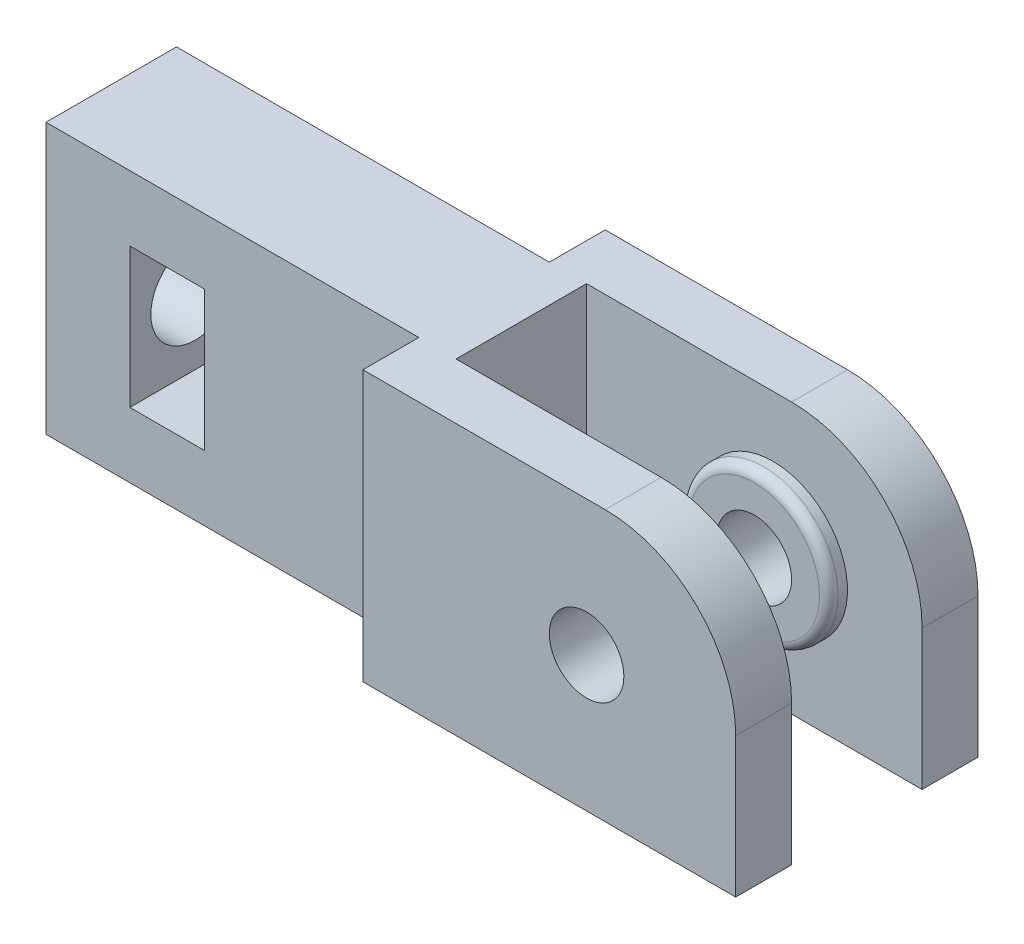
ISO-10303-21;
HEADER;
FILE_DESCRIPTION(('STEP AP214'),'2;1');
FILE_NAME('part.step','',(''),(''),'','','');
FILE_SCHEMA(('AUTOMOTIVE_DESIGN { 1 0 10303 214 1 1 1 1 }'));
ENDSEC;
DATA;
#1=APPLICATION_CONTEXT('core data for automotive mechanical design processes');
#2=APPLICATION_PROTOCOL_DEFINITION('international standard','automotive_design',2000,#1);
#3=PRODUCT_CONTEXT('',#1,'mechanical');
#4=PRODUCT('Part','Part','',(#3));
#5=PRODUCT_RELATED_PRODUCT_CATEGORY('part','',(#4));
#6=PRODUCT_DEFINITION_FORMATION('','',#4);
#7=PRODUCT_DEFINITION_CONTEXT('part definition',#1,'design');
#8=PRODUCT_DEFINITION('design','',#6,#7);
#9=PRODUCT_DEFINITION_SHAPE('','',#8);
#10=(LENGTH_UNIT() NAMED_UNIT(*) SI_UNIT(.MILLI.,.METRE.));
#11=(NAMED_UNIT(*) PLANE_ANGLE_UNIT() SI_UNIT($,.RADIAN.));
#12=(NAMED_UNIT(*) SI_UNIT($,.STERADIAN.) SOLID_ANGLE_UNIT());
#13=UNCERTAINTY_MEASURE_WITH_UNIT(LENGTH_MEASURE(1.E-05),#10,'distance_accuracy_value','');
#14=(GEOMETRIC_REPRESENTATION_CONTEXT(3) GLOBAL_UNCERTAINTY_ASSIGNED_CONTEXT((#13)) GLOBAL_UNIT_ASSIGNED_CONTEXT((#10,
#11,#12)) REPRESENTATION_CONTEXT('',''));
#15=CARTESIAN_POINT('',(0.,0.,0.));
#16=DIRECTION('',(0.,0.,1.));
#17=DIRECTION('',(1.,0.,0.));
#18=AXIS2_PLACEMENT_3D('',#15,#16,#17);
#19=CARTESIAN_POINT('',(40.,7.25,0.));
#20=DIRECTION('',(-1.,0.,0.));
#21=DIRECTION('',(0.,0.,1.));
#22=AXIS2_PLACEMENT_3D('',#19,#20,#21);
#23=CYLINDRICAL_SURFACE('',#22,2.375);
#24=CARTESIAN_POINT('',(4.5,7.25,0.));
#25=DIRECTION('',(-1.,0.,0.));
#26=DIRECTION('',(0.,-1.,0.));
#27=AXIS2_PLACEMENT_3D('',#24,#25,#26);
#28=CIRCLE('',#27,2.375);
#29=CARTESIAN_POINT('',(4.5,4.875,0.));
#30=VERTEX_POINT('',#29);
#31=EDGE_CURVE('E188',#30,#30,#28,.F.);
#32=ORIENTED_EDGE('',*,*,#31,.T.);
#33=EDGE_LOOP('',(#32));
#34=FACE_BOUND('',#33,.T.);
#35=CARTESIAN_POINT('',(0.,7.25,0.));
#36=DIRECTION('',(-1.,0.,0.));
#37=DIRECTION('',(0.,0.,1.));
#38=AXIS2_PLACEMENT_3D('',#35,#36,#37);
#39=CIRCLE('',#38,2.375);
#40=CARTESIAN_POINT('',(0.,7.25,2.375));
#41=VERTEX_POINT('',#40);
#42=EDGE_CURVE('E192',#41,#41,#39,.T.);
#43=ORIENTED_EDGE('',*,*,#42,.T.);
#44=EDGE_LOOP('',(#43));
#45=FACE_BOUND('',#44,.T.);
#46=ADVANCED_FACE('F33',(#34,#45),#23,.F.);
#47=CARTESIAN_POINT('',(40.,14.5,-3.5));
#48=DIRECTION('',(0.,0.,-1.));
#49=DIRECTION('',(-1.,0.,0.));
#50=AXIS2_PLACEMENT_3D('',#47,#48,#49);
#51=PLANE('',#50);
#52=DIRECTION('',(0.,-1.,0.));
#53=VECTOR('',#52,1.);
#54=CARTESIAN_POINT('',(40.,14.5,-3.5));
#55=LINE('',#54,#53);
#56=CARTESIAN_POINT('',(40.,7.5,-3.5));
#57=VERTEX_POINT('',#56);
#58=CARTESIAN_POINT('',(40.,0.,-3.5));
#59=VERTEX_POINT('',#58);
#60=EDGE_CURVE('E313',#57,#59,#55,.T.);
#61=ORIENTED_EDGE('',*,*,#60,.F.);
#62=CARTESIAN_POINT('',(33.,7.5,-3.5));
#63=DIRECTION('',(0.,0.,-1.));
#64=DIRECTION('',(-1.,0.,0.));
#65=AXIS2_PLACEMENT_3D('',#62,#63,#64);
#66=CIRCLE('',#65,7.);
#67=CARTESIAN_POINT('',(33.,14.5,-3.5));
#68=VERTEX_POINT('',#67);
#69=EDGE_CURVE('E325',#57,#68,#66,.F.);
#70=ORIENTED_EDGE('',*,*,#69,.T.);
#71=DIRECTION('',(1.,0.,0.));
#72=VECTOR('',#71,1.);
#73=CARTESIAN_POINT('',(40.,14.5,-3.5));
#74=LINE('',#73,#72);
#75=CARTESIAN_POINT('',(22.,14.5,-3.5));
#76=VERTEX_POINT('',#75);
#77=EDGE_CURVE('E276',#76,#68,#74,.T.);
#78=ORIENTED_EDGE('',*,*,#77,.F.);
#79=DIRECTION('',(0.,-1.,0.));
#80=VECTOR('',#79,1.);
#81=CARTESIAN_POINT('',(22.,14.5,-3.5));
#82=LINE('',#81,#80);
#83=CARTESIAN_POINT('',(22.,0.,-3.5));
#84=VERTEX_POINT('',#83);
#85=EDGE_CURVE('E315',#76,#84,#82,.T.);
#86=ORIENTED_EDGE('',*,*,#85,.T.);
#87=DIRECTION('',(1.,0.,0.));
#88=VECTOR('',#87,1.);
#89=CARTESIAN_POINT('',(40.,0.,-3.5));
#90=LINE('',#89,#88);
#91=EDGE_CURVE('E290',#84,#59,#90,.T.);
#92=ORIENTED_EDGE('',*,*,#91,.T.);
#93=EDGE_LOOP('',(#61,#70,#78,#86,#92));
#94=FACE_BOUND('',#93,.T.);
#95=CARTESIAN_POINT('',(32.,7.25,-3.5));
#96=DIRECTION('',(0.,0.,-1.));
#97=DIRECTION('',(-1.,0.,0.));
#98=AXIS2_PLACEMENT_3D('',#95,#96,#97);
#99=CIRCLE('',#98,4.00000000000001);
#100=CARTESIAN_POINT('',(28.,7.25,-3.5));
#101=VERTEX_POINT('',#100);
#102=EDGE_CURVE('E327',#101,#101,#99,.F.);
#103=ORIENTED_EDGE('',*,*,#102,.F.);
#104=EDGE_LOOP('',(#103));
#105=FACE_BOUND('',#104,.T.);
#106=ADVANCED_FACE('F359',(#94,#105),#51,.F.);
#107=CARTESIAN_POINT('',(22.,14.5,-3.5));
#108=DIRECTION('',(-1.,0.,0.));
#109=DIRECTION('',(0.,0.,1.));
#110=AXIS2_PLACEMENT_3D('',#107,#108,#109);
#111=PLANE('',#110);
#112=CARTESIAN_POINT('',(22.,7.25,0.));
#113=DIRECTION('',(-1.,0.,0.));
#114=DIRECTION('',(0.,0.,1.));
#115=AXIS2_PLACEMENT_3D('',#112,#113,#114);
#116=CIRCLE('',#115,2.375);
#117=CARTESIAN_POINT('',(22.,7.25,2.375));
#118=VERTEX_POINT('',#117);
#119=EDGE_CURVE('E195',#118,#118,#116,.T.);
#120=ORIENTED_EDGE('',*,*,#119,.T.);
#121=EDGE_LOOP('',(#120));
#122=FACE_BOUND('',#121,.T.);
#123=DIRECTION('',(0.,0.,-1.));
#124=VECTOR('',#123,1.);
#125=CARTESIAN_POINT('',(22.,0.,-3.5));
#126=LINE('',#125,#124);
#127=CARTESIAN_POINT('',(22.,0.,3.5));
#128=VERTEX_POINT('',#127);
#129=EDGE_CURVE('E271',#128,#84,#126,.T.);
#130=ORIENTED_EDGE('',*,*,#129,.T.);
#131=ORIENTED_EDGE('',*,*,#85,.F.);
#132=DIRECTION('',(0.,0.,-1.));
#133=VECTOR('',#132,1.);
#134=CARTESIAN_POINT('',(22.,14.5,-3.5));
#135=LINE('',#134,#133);
#136=CARTESIAN_POINT('',(22.,14.5,3.5));
#137=VERTEX_POINT('',#136);
#138=EDGE_CURVE('E274',#137,#76,#135,.T.);
#139=ORIENTED_EDGE('',*,*,#138,.F.);
#140=DIRECTION('',(0.,-1.,0.));
#141=VECTOR('',#140,1.);
#142=CARTESIAN_POINT('',(22.,14.5,3.5));
#143=LINE('',#142,#141);
#144=EDGE_CURVE('E246',#137,#128,#143,.T.);
#145=ORIENTED_EDGE('',*,*,#144,.T.);
#146=EDGE_LOOP('',(#130,#131,#139,#145));
#147=FACE_BOUND('',#146,.T.);
#148=ADVANCED_FACE('F364',(#122,#147),#111,.F.);
#149=CARTESIAN_POINT('',(40.,14.5,-6.5));
#150=DIRECTION('',(-1.,0.,0.));
#151=DIRECTION('',(0.,0.,1.));
#152=AXIS2_PLACEMENT_3D('',#149,#150,#151);
#153=PLANE('',#152);
#154=DIRECTION('',(0.,-1.,0.));
#155=VECTOR('',#154,1.);
#156=CARTESIAN_POINT('',(40.,14.5,-6.5));
#157=LINE('',#156,#155);
#158=CARTESIAN_POINT('',(40.,7.5,-6.5));
#159=VERTEX_POINT('',#158);
#160=CARTESIAN_POINT('',(40.,0.,-6.5));
#161=VERTEX_POINT('',#160);
#162=EDGE_CURVE('E311',#159,#161,#157,.T.);
#163=ORIENTED_EDGE('',*,*,#162,.F.);
#164=DIRECTION('',(0.,0.,-1.));
#165=VECTOR('',#164,1.);
#166=CARTESIAN_POINT('',(40.,7.5,-6.5));
#167=LINE('',#166,#165);
#168=EDGE_CURVE('E323',#159,#57,#167,.F.);
#169=ORIENTED_EDGE('',*,*,#168,.T.);
#170=ORIENTED_EDGE('',*,*,#60,.T.);
#171=DIRECTION('',(0.,0.,-1.));
#172=VECTOR('',#171,1.);
#173=CARTESIAN_POINT('',(40.,0.,-6.5));
#174=LINE('',#173,#172);
#175=EDGE_CURVE('E293',#59,#161,#174,.T.);
#176=ORIENTED_EDGE('',*,*,#175,.T.);
#177=EDGE_LOOP('',(#163,#169,#170,#176));
#178=FACE_BOUND('',#177,.T.);
#179=ADVANCED_FACE('F441',(#178),#153,.F.);
#180=CARTESIAN_POINT('',(20.,14.5,-6.5));
#181=DIRECTION('',(0.,0.,1.));
#182=DIRECTION('',(1.,0.,0.));
#183=AXIS2_PLACEMENT_3D('',#180,#181,#182);
#184=PLANE('',#183);
#185=CARTESIAN_POINT('',(32.,7.25,-6.5));
#186=DIRECTION('',(0.,0.,1.));
#187=DIRECTION('',(1.,0.,0.));
#188=AXIS2_PLACEMENT_3D('',#185,#186,#187);
#189=CIRCLE('',#188,2.);
#190=CARTESIAN_POINT('',(34.,7.25,-6.5));
#191=VERTEX_POINT('',#190);
#192=EDGE_CURVE('E268',#191,#191,#189,.T.);
#193=ORIENTED_EDGE('',*,*,#192,.T.);
#194=EDGE_LOOP('',(#193));
#195=FACE_BOUND('',#194,.T.);
#196=DIRECTION('',(-1.,0.,0.));
#197=VECTOR('',#196,1.);
#198=CARTESIAN_POINT('',(20.,14.5,-6.5));
#199=LINE('',#198,#197);
#200=CARTESIAN_POINT('',(33.,14.5,-6.5));
#201=VERTEX_POINT('',#200);
#202=CARTESIAN_POINT('',(20.,14.5,-6.5));
#203=VERTEX_POINT('',#202);
#204=EDGE_CURVE('E280',#201,#203,#199,.T.);
#205=ORIENTED_EDGE('',*,*,#204,.F.);
#206=CARTESIAN_POINT('',(33.,7.5,-6.5));
#207=DIRECTION('',(0.,0.,1.));
#208=DIRECTION('',(1.,0.,0.));
#209=AXIS2_PLACEMENT_3D('',#206,#207,#208);
#210=CIRCLE('',#209,7.);
#211=EDGE_CURVE('E321',#201,#159,#210,.F.);
#212=ORIENTED_EDGE('',*,*,#211,.T.);
#213=ORIENTED_EDGE('',*,*,#162,.T.);
#214=DIRECTION('',(-1.,0.,0.));
#215=VECTOR('',#214,1.);
#216=CARTESIAN_POINT('',(20.,0.,-6.5));
#217=LINE('',#216,#215);
#218=CARTESIAN_POINT('',(20.,0.,-6.5));
#219=VERTEX_POINT('',#218);
#220=EDGE_CURVE('E296',#161,#219,#217,.T.);
#221=ORIENTED_EDGE('',*,*,#220,.T.);
#222=DIRECTION('',(0.,-1.,0.));
#223=VECTOR('',#222,1.);
#224=CARTESIAN_POINT('',(20.,14.5,-6.5));
#225=LINE('',#224,#223);
#226=EDGE_CURVE('E308',#203,#219,#225,.T.);
#227=ORIENTED_EDGE('',*,*,#226,.F.);
#228=EDGE_LOOP('',(#205,#212,#213,#221,#227));
#229=FACE_BOUND('',#228,.T.);
#230=ADVANCED_FACE('F437',(#195,#229),#184,.F.);
#231=CARTESIAN_POINT('',(20.,14.5,-3.5));
#232=DIRECTION('',(1.,0.,0.));
#233=DIRECTION('',(0.,0.,-1.));
#234=AXIS2_PLACEMENT_3D('',#231,#232,#233);
#235=PLANE('',#234);
#236=DIRECTION('',(0.,0.,1.));
#237=VECTOR('',#236,1.);
#238=CARTESIAN_POINT('',(20.,0.,-3.5));
#239=LINE('',#238,#237);
#240=CARTESIAN_POINT('',(20.,0.,-3.5));
#241=VERTEX_POINT('',#240);
#242=EDGE_CURVE('E298',#219,#241,#239,.T.);
#243=ORIENTED_EDGE('',*,*,#242,.T.);
#244=DIRECTION('',(0.,-1.,0.));
#245=VECTOR('',#244,1.);
#246=CARTESIAN_POINT('',(20.,14.5,-3.5));
#247=LINE('',#246,#245);
#248=CARTESIAN_POINT('',(20.,14.5,-3.5));
#249=VERTEX_POINT('',#248);
#250=EDGE_CURVE('E305',#249,#241,#247,.T.);
#251=ORIENTED_EDGE('',*,*,#250,.F.);
#252=DIRECTION('',(0.,0.,1.));
#253=VECTOR('',#252,1.);
#254=CARTESIAN_POINT('',(20.,14.5,-3.5));
#255=LINE('',#254,#253);
#256=EDGE_CURVE('E282',#203,#249,#255,.T.);
#257=ORIENTED_EDGE('',*,*,#256,.F.);
#258=ORIENTED_EDGE('',*,*,#226,.T.);
#259=EDGE_LOOP('',(#243,#251,#257,#258));
#260=FACE_BOUND('',#259,.T.);
#261=ADVANCED_FACE('F434',(#260),#235,.F.);
#262=CARTESIAN_POINT('',(0.,14.5,-3.5));
#263=DIRECTION('',(0.,0.,1.));
#264=DIRECTION('',(1.,0.,0.));
#265=AXIS2_PLACEMENT_3D('',#262,#263,#264);
#266=PLANE('',#265);
#267=DIRECTION('',(1.,0.,0.));
#268=VECTOR('',#267,1.);
#269=CARTESIAN_POINT('',(8.5,11.,-3.5));
#270=LINE('',#269,#268);
#271=CARTESIAN_POINT('',(4.5,11.,-3.5));
#272=VERTEX_POINT('',#271);
#273=CARTESIAN_POINT('',(8.5,11.,-3.5));
#274=VERTEX_POINT('',#273);
#275=EDGE_CURVE('E170',#272,#274,#270,.T.);
#276=ORIENTED_EDGE('',*,*,#275,.F.);
#277=DIRECTION('',(0.,1.,0.));
#278=VECTOR('',#277,1.);
#279=CARTESIAN_POINT('',(4.5,11.,-3.5));
#280=LINE('',#279,#278);
#281=CARTESIAN_POINT('',(4.5,3.5,-3.5));
#282=VERTEX_POINT('',#281);
#283=EDGE_CURVE('E48',#282,#272,#280,.T.);
#284=ORIENTED_EDGE('',*,*,#283,.F.);
#285=DIRECTION('',(-1.,0.,0.));
#286=VECTOR('',#285,1.);
#287=CARTESIAN_POINT('',(8.5,3.5,-3.5));
#288=LINE('',#287,#286);
#289=CARTESIAN_POINT('',(8.5,3.5,-3.5));
#290=VERTEX_POINT('',#289);
#291=EDGE_CURVE('E177',#290,#282,#288,.T.);
#292=ORIENTED_EDGE('',*,*,#291,.F.);
#293=DIRECTION('',(0.,-1.,0.));
#294=VECTOR('',#293,1.);
#295=CARTESIAN_POINT('',(8.5,11.,-3.5));
#296=LINE('',#295,#294);
#297=EDGE_CURVE('E161',#274,#290,#296,.T.);
#298=ORIENTED_EDGE('',*,*,#297,.F.);
#299=EDGE_LOOP('',(#276,#284,#292,#298));
#300=FACE_BOUND('',#299,.T.);
#301=DIRECTION('',(-1.,0.,0.));
#302=VECTOR('',#301,1.);
#303=CARTESIAN_POINT('',(0.,0.,-3.5));
#304=LINE('',#303,#302);
#305=CARTESIAN_POINT('',(0.,0.,-3.5));
#306=VERTEX_POINT('',#305);
#307=EDGE_CURVE('E300',#241,#306,#304,.T.);
#308=ORIENTED_EDGE('',*,*,#307,.T.);
#309=DIRECTION('',(0.,-1.,0.));
#310=VECTOR('',#309,1.);
#311=CARTESIAN_POINT('',(0.,14.5,-3.5));
#312=LINE('',#311,#310);
#313=CARTESIAN_POINT('',(0.,14.5,-3.5));
#314=VERTEX_POINT('',#313);
#315=EDGE_CURVE('E288',#314,#306,#312,.T.);
#316=ORIENTED_EDGE('',*,*,#315,.F.);
#317=DIRECTION('',(-1.,0.,0.));
#318=VECTOR('',#317,1.);
#319=CARTESIAN_POINT('',(0.,14.5,-3.5));
#320=LINE('',#319,#318);
#321=EDGE_CURVE('E284',#249,#314,#320,.T.);
#322=ORIENTED_EDGE('',*,*,#321,.F.);
#323=ORIENTED_EDGE('',*,*,#250,.T.);
#324=EDGE_LOOP('',(#308,#316,#322,#323));
#325=FACE_BOUND('',#324,.T.);
#326=ADVANCED_FACE('F174',(#300,#325),#266,.F.);
#327=CARTESIAN_POINT('',(0.,14.5,0.));
#328=DIRECTION('',(1.,0.,0.));
#329=DIRECTION('',(0.,0.,-1.));
#330=AXIS2_PLACEMENT_3D('',#327,#328,#329);
#331=PLANE('',#330);
#332=ORIENTED_EDGE('',*,*,#42,.F.);
#333=EDGE_LOOP('',(#332));
#334=FACE_BOUND('',#333,.T.);
#335=DIRECTION('',(0.,0.,1.));
#336=VECTOR('',#335,1.);
#337=CARTESIAN_POINT('',(0.,0.,0.));
#338=LINE('',#337,#336);
#339=CARTESIAN_POINT('',(0.,0.,3.5));
#340=VERTEX_POINT('',#339);
#341=EDGE_CURVE('E277',#306,#340,#338,.T.);
#342=ORIENTED_EDGE('',*,*,#341,.T.);
#343=DIRECTION('',(0.,-1.,0.));
#344=VECTOR('',#343,1.);
#345=CARTESIAN_POINT('',(0.,14.5,3.5));
#346=LINE('',#345,#344);
#347=CARTESIAN_POINT('',(0.,14.5,3.5));
#348=VERTEX_POINT('',#347);
#349=EDGE_CURVE('E218',#348,#340,#346,.T.);
#350=ORIENTED_EDGE('',*,*,#349,.F.);
#351=DIRECTION('',(0.,0.,1.));
#352=VECTOR('',#351,1.);
#353=CARTESIAN_POINT('',(0.,14.5,0.));
#354=LINE('',#353,#352);
#355=EDGE_CURVE('E286',#314,#348,#354,.T.);
#356=ORIENTED_EDGE('',*,*,#355,.F.);
#357=ORIENTED_EDGE('',*,*,#315,.T.);
#358=EDGE_LOOP('',(#342,#350,#356,#357));
#359=FACE_BOUND('',#358,.T.);
#360=ADVANCED_FACE('F424',(#334,#359),#331,.F.);
#361=CARTESIAN_POINT('',(0.,14.5,0.));
#362=DIRECTION('',(0.,-1.,0.));
#363=DIRECTION('',(0.,0.,-1.));
#364=AXIS2_PLACEMENT_3D('',#361,#362,#363);
#365=PLANE('',#364);
#366=ORIENTED_EDGE('',*,*,#77,.T.);
#367=DIRECTION('',(0.,0.,-1.));
#368=VECTOR('',#367,1.);
#369=CARTESIAN_POINT('',(33.,14.5,0.));
#370=LINE('',#369,#368);
#371=EDGE_CURVE('E318',#68,#201,#370,.T.);
#372=ORIENTED_EDGE('',*,*,#371,.T.);
#373=ORIENTED_EDGE('',*,*,#204,.T.);
#374=ORIENTED_EDGE('',*,*,#256,.T.);
#375=ORIENTED_EDGE('',*,*,#321,.T.);
#376=ORIENTED_EDGE('',*,*,#355,.T.);
#377=DIRECTION('',(-1.,0.,0.));
#378=VECTOR('',#377,1.);
#379=CARTESIAN_POINT('',(0.,14.5,3.5));
#380=LINE('',#379,#378);
#381=CARTESIAN_POINT('',(20.,14.5,3.5));
#382=VERTEX_POINT('',#381);
#383=EDGE_CURVE('E215',#382,#348,#380,.T.);
#384=ORIENTED_EDGE('',*,*,#383,.F.);
#385=DIRECTION('',(0.,0.,-1.));
#386=VECTOR('',#385,1.);
#387=CARTESIAN_POINT('',(20.,14.5,3.5));
#388=LINE('',#387,#386);
#389=CARTESIAN_POINT('',(20.,14.5,6.5));
#390=VERTEX_POINT('',#389);
#391=EDGE_CURVE('E212',#390,#382,#388,.T.);
#392=ORIENTED_EDGE('',*,*,#391,.F.);
#393=DIRECTION('',(-1.,0.,0.));
#394=VECTOR('',#393,1.);
#395=CARTESIAN_POINT('',(20.,14.5,6.5));
#396=LINE('',#395,#394);
#397=CARTESIAN_POINT('',(33.,14.5,6.5));
#398=VERTEX_POINT('',#397);
#399=EDGE_CURVE('E208',#398,#390,#396,.T.);
#400=ORIENTED_EDGE('',*,*,#399,.F.);
#401=DIRECTION('',(0.,0.,1.));
#402=VECTOR('',#401,1.);
#403=CARTESIAN_POINT('',(33.,14.5,0.));
#404=LINE('',#403,#402);
#405=CARTESIAN_POINT('',(33.,14.5,3.5));
#406=VERTEX_POINT('',#405);
#407=EDGE_CURVE('E249',#406,#398,#404,.T.);
#408=ORIENTED_EDGE('',*,*,#407,.F.);
#409=DIRECTION('',(1.,0.,0.));
#410=VECTOR('',#409,1.);
#411=CARTESIAN_POINT('',(40.,14.5,3.5));
#412=LINE('',#411,#410);
#413=EDGE_CURVE('E205',#137,#406,#412,.T.);
#414=ORIENTED_EDGE('',*,*,#413,.F.);
#415=ORIENTED_EDGE('',*,*,#138,.T.);
#416=EDGE_LOOP('',(#366,#372,#373,#374,#375,#376,#384,#392,#400,#408,#414,#415));
#417=FACE_BOUND('',#416,.T.);
#418=ADVANCED_FACE('F420',(#417),#365,.F.);
#419=CARTESIAN_POINT('',(0.,0.,0.));
#420=DIRECTION('',(0.,-1.,0.));
#421=DIRECTION('',(0.,0.,-1.));
#422=AXIS2_PLACEMENT_3D('',#419,#420,#421);
#423=PLANE('',#422);
#424=ORIENTED_EDGE('',*,*,#129,.F.);
#425=DIRECTION('',(1.,0.,0.));
#426=VECTOR('',#425,1.);
#427=CARTESIAN_POINT('',(40.,0.,3.5));
#428=LINE('',#427,#426);
#429=CARTESIAN_POINT('',(40.,0.,3.5));
#430=VERTEX_POINT('',#429);
#431=EDGE_CURVE('E202',#128,#430,#428,.T.);
#432=ORIENTED_EDGE('',*,*,#431,.T.);
#433=DIRECTION('',(0.,0.,1.));
#434=VECTOR('',#433,1.);
#435=CARTESIAN_POINT('',(40.,0.,6.5));
#436=LINE('',#435,#434);
#437=CARTESIAN_POINT('',(40.,0.,6.5));
#438=VERTEX_POINT('',#437);
#439=EDGE_CURVE('E221',#430,#438,#436,.T.);
#440=ORIENTED_EDGE('',*,*,#439,.T.);
#441=DIRECTION('',(-1.,0.,0.));
#442=VECTOR('',#441,1.);
#443=CARTESIAN_POINT('',(20.,0.,6.5));
#444=LINE('',#443,#442);
#445=CARTESIAN_POINT('',(20.,0.,6.5));
#446=VERTEX_POINT('',#445);
#447=EDGE_CURVE('E224',#438,#446,#444,.T.);
#448=ORIENTED_EDGE('',*,*,#447,.T.);
#449=DIRECTION('',(0.,0.,-1.));
#450=VECTOR('',#449,1.);
#451=CARTESIAN_POINT('',(20.,0.,3.5));
#452=LINE('',#451,#450);
#453=CARTESIAN_POINT('',(20.,0.,3.5));
#454=VERTEX_POINT('',#453);
#455=EDGE_CURVE('E227',#446,#454,#452,.T.);
#456=ORIENTED_EDGE('',*,*,#455,.T.);
#457=DIRECTION('',(-1.,0.,0.));
#458=VECTOR('',#457,1.);
#459=CARTESIAN_POINT('',(0.,0.,3.5));
#460=LINE('',#459,#458);
#461=EDGE_CURVE('E209',#454,#340,#460,.T.);
#462=ORIENTED_EDGE('',*,*,#461,.T.);
#463=ORIENTED_EDGE('',*,*,#341,.F.);
#464=ORIENTED_EDGE('',*,*,#307,.F.);
#465=ORIENTED_EDGE('',*,*,#242,.F.);
#466=ORIENTED_EDGE('',*,*,#220,.F.);
#467=ORIENTED_EDGE('',*,*,#175,.F.);
#468=ORIENTED_EDGE('',*,*,#91,.F.);
#469=EDGE_LOOP('',(#424,#432,#440,#448,#456,#462,#463,#464,#465,#466,#467,#468));
#470=FACE_BOUND('',#469,.T.);
#471=ADVANCED_FACE('F423',(#470),#423,.T.);
#472=CARTESIAN_POINT('',(33.,7.5,0.));
#473=DIRECTION('',(0.,0.,-1.));
#474=DIRECTION('',(-1.,0.,0.));
#475=AXIS2_PLACEMENT_3D('',#472,#473,#474);
#476=CYLINDRICAL_SURFACE('',#475,7.);
#477=ORIENTED_EDGE('',*,*,#69,.F.);
#478=ORIENTED_EDGE('',*,*,#168,.F.);
#479=ORIENTED_EDGE('',*,*,#211,.F.);
#480=ORIENTED_EDGE('',*,*,#371,.F.);
#481=EDGE_LOOP('',(#477,#478,#479,#480));
#482=FACE_BOUND('',#481,.T.);
#483=ADVANCED_FACE('F418',(#482),#476,.T.);
#484=CARTESIAN_POINT('',(32.,7.25,-2.5));
#485=DIRECTION('',(0.,0.,-1.));
#486=DIRECTION('',(-1.,0.,0.));
#487=AXIS2_PLACEMENT_3D('',#484,#485,#486);
#488=CYLINDRICAL_SURFACE('',#487,4.00000000000001);
#489=CARTESIAN_POINT('',(32.,7.25,-3.));
#490=DIRECTION('',(0.,0.,1.));
#491=DIRECTION('',(1.,0.,0.));
#492=AXIS2_PLACEMENT_3D('',#489,#490,#491);
#493=CIRCLE('',#492,4.00000000000001);
#494=CARTESIAN_POINT('',(36.,7.25,-3.));
#495=VERTEX_POINT('',#494);
#496=EDGE_CURVE('E333',#495,#495,#493,.F.);
#497=ORIENTED_EDGE('',*,*,#496,.T.);
#498=EDGE_LOOP('',(#497));
#499=FACE_BOUND('',#498,.T.);
#500=ORIENTED_EDGE('',*,*,#102,.T.);
#501=EDGE_LOOP('',(#500));
#502=FACE_BOUND('',#501,.T.);
#503=ADVANCED_FACE('F414',(#499,#502),#488,.T.);
#504=CARTESIAN_POINT('',(32.,7.25,-2.5));
#505=DIRECTION('',(0.,0.,1.));
#506=DIRECTION('',(1.,0.,0.));
#507=AXIS2_PLACEMENT_3D('',#504,#505,#506);
#508=PLANE('',#507);
#509=CARTESIAN_POINT('',(32.,7.25,-2.5));
#510=DIRECTION('',(0.,0.,1.));
#511=DIRECTION('',(1.,0.,0.));
#512=AXIS2_PLACEMENT_3D('',#509,#510,#511);
#513=CIRCLE('',#512,2.);
#514=CARTESIAN_POINT('',(34.,7.25,-2.5));
#515=VERTEX_POINT('',#514);
#516=EDGE_CURVE('E267',#515,#515,#513,.T.);
#517=ORIENTED_EDGE('',*,*,#516,.F.);
#518=EDGE_LOOP('',(#517));
#519=FACE_BOUND('',#518,.T.);
#520=CARTESIAN_POINT('',(32.,7.25,-2.5));
#521=DIRECTION('',(0.,0.,1.));
#522=DIRECTION('',(1.,0.,0.));
#523=AXIS2_PLACEMENT_3D('',#520,#521,#522);
#524=CIRCLE('',#523,3.50000000000001);
#525=CARTESIAN_POINT('',(35.5,7.25,-2.5));
#526=VERTEX_POINT('',#525);
#527=EDGE_CURVE('E330',#526,#526,#524,.T.);
#528=ORIENTED_EDGE('',*,*,#527,.T.);
#529=EDGE_LOOP('',(#528));
#530=FACE_BOUND('',#529,.T.);
#531=ADVANCED_FACE('F411',(#519,#530),#508,.T.);
#532=CARTESIAN_POINT('',(32.,7.25,-3.));
#533=DIRECTION('',(0.,0.,1.));
#534=DIRECTION('',(1.,0.,0.));
#535=AXIS2_PLACEMENT_3D('',#532,#533,#534);
#536=TOROIDAL_SURFACE('',#535,3.50000000000001,0.5);
#537=ORIENTED_EDGE('',*,*,#496,.F.);
#538=EDGE_LOOP('',(#537));
#539=FACE_BOUND('',#538,.T.);
#540=ORIENTED_EDGE('',*,*,#527,.F.);
#541=EDGE_LOOP('',(#540));
#542=FACE_BOUND('',#541,.T.);
#543=ADVANCED_FACE('F35',(#539,#542),#536,.T.);
#544=CARTESIAN_POINT('',(32.,7.25,-6.5));
#545=DIRECTION('',(0.,0.,1.));
#546=DIRECTION('',(1.,0.,0.));
#547=AXIS2_PLACEMENT_3D('',#544,#545,#546);
#548=CYLINDRICAL_SURFACE('',#547,2.);
#549=ORIENTED_EDGE('',*,*,#192,.F.);
#550=EDGE_LOOP('',(#549));
#551=FACE_BOUND('',#550,.T.);
#552=ORIENTED_EDGE('',*,*,#516,.T.);
#553=EDGE_LOOP('',(#552));
#554=FACE_BOUND('',#553,.T.);
#555=ADVANCED_FACE('F400',(#551,#554),#548,.F.);
#556=CARTESIAN_POINT('',(40.,14.5,3.5));
#557=DIRECTION('',(0.,0.,1.));
#558=DIRECTION('',(-1.,0.,0.));
#559=AXIS2_PLACEMENT_3D('',#556,#557,#558);
#560=PLANE('',#559);
#561=DIRECTION('',(0.,-1.,0.));
#562=VECTOR('',#561,1.);
#563=CARTESIAN_POINT('',(40.,14.5,3.5));
#564=LINE('',#563,#562);
#565=CARTESIAN_POINT('',(40.,7.5,3.5));
#566=VERTEX_POINT('',#565);
#567=EDGE_CURVE('E243',#566,#430,#564,.T.);
#568=ORIENTED_EDGE('',*,*,#567,.T.);
#569=ORIENTED_EDGE('',*,*,#431,.F.);
#570=ORIENTED_EDGE('',*,*,#144,.F.);
#571=ORIENTED_EDGE('',*,*,#413,.T.);
#572=CARTESIAN_POINT('',(33.,7.5,3.5));
#573=DIRECTION('',(0.,0.,-1.));
#574=DIRECTION('',(-1.,0.,0.));
#575=AXIS2_PLACEMENT_3D('',#572,#573,#574);
#576=CIRCLE('',#575,7.);
#577=EDGE_CURVE('E255',#566,#406,#576,.F.);
#578=ORIENTED_EDGE('',*,*,#577,.F.);
#579=EDGE_LOOP('',(#568,#569,#570,#571,#578));
#580=FACE_BOUND('',#579,.T.);
#581=CARTESIAN_POINT('',(32.,7.25,3.5));
#582=DIRECTION('',(0.,0.,-1.));
#583=DIRECTION('',(-1.,0.,0.));
#584=AXIS2_PLACEMENT_3D('',#581,#582,#583);
#585=CIRCLE('',#584,4.00000000000001);
#586=CARTESIAN_POINT('',(28.,7.25,3.5));
#587=VERTEX_POINT('',#586);
#588=EDGE_CURVE('E258',#587,#587,#585,.F.);
#589=ORIENTED_EDGE('',*,*,#588,.T.);
#590=EDGE_LOOP('',(#589));
#591=FACE_BOUND('',#590,.T.);
#592=ADVANCED_FACE('F396',(#580,#591),#560,.F.);
#593=CARTESIAN_POINT('',(40.,14.5,6.5));
#594=DIRECTION('',(-1.,0.,0.));
#595=DIRECTION('',(0.,0.,-1.));
#596=AXIS2_PLACEMENT_3D('',#593,#594,#595);
#597=PLANE('',#596);
#598=DIRECTION('',(0.,-1.,0.));
#599=VECTOR('',#598,1.);
#600=CARTESIAN_POINT('',(40.,14.5,6.5));
#601=LINE('',#600,#599);
#602=CARTESIAN_POINT('',(40.,7.5,6.5));
#603=VERTEX_POINT('',#602);
#604=EDGE_CURVE('E240',#603,#438,#601,.T.);
#605=ORIENTED_EDGE('',*,*,#604,.T.);
#606=ORIENTED_EDGE('',*,*,#439,.F.);
#607=ORIENTED_EDGE('',*,*,#567,.F.);
#608=DIRECTION('',(0.,0.,1.));
#609=VECTOR('',#608,1.);
#610=CARTESIAN_POINT('',(40.,7.5,6.5));
#611=LINE('',#610,#609);
#612=EDGE_CURVE('E253',#603,#566,#611,.F.);
#613=ORIENTED_EDGE('',*,*,#612,.F.);
#614=EDGE_LOOP('',(#605,#606,#607,#613));
#615=FACE_BOUND('',#614,.T.);
#616=ADVANCED_FACE('F392',(#615),#597,.F.);
#617=CARTESIAN_POINT('',(20.,14.5,6.5));
#618=DIRECTION('',(0.,0.,-1.));
#619=DIRECTION('',(1.,0.,0.));
#620=AXIS2_PLACEMENT_3D('',#617,#618,#619);
#621=PLANE('',#620);
#622=CARTESIAN_POINT('',(32.,7.25,6.5));
#623=DIRECTION('',(0.,0.,1.));
#624=DIRECTION('',(1.,0.,0.));
#625=AXIS2_PLACEMENT_3D('',#622,#623,#624);
#626=CIRCLE('',#625,2.);
#627=CARTESIAN_POINT('',(34.,7.25,6.5));
#628=VERTEX_POINT('',#627);
#629=EDGE_CURVE('E199',#628,#628,#626,.T.);
#630=ORIENTED_EDGE('',*,*,#629,.F.);
#631=EDGE_LOOP('',(#630));
#632=FACE_BOUND('',#631,.T.);
#633=ORIENTED_EDGE('',*,*,#399,.T.);
#634=DIRECTION('',(0.,-1.,0.));
#635=VECTOR('',#634,1.);
#636=CARTESIAN_POINT('',(20.,14.5,6.5));
#637=LINE('',#636,#635);
#638=EDGE_CURVE('E237',#390,#446,#637,.T.);
#639=ORIENTED_EDGE('',*,*,#638,.T.);
#640=ORIENTED_EDGE('',*,*,#447,.F.);
#641=ORIENTED_EDGE('',*,*,#604,.F.);
#642=CARTESIAN_POINT('',(33.,7.5,6.5));
#643=DIRECTION('',(0.,0.,1.));
#644=DIRECTION('',(1.,0.,0.));
#645=AXIS2_PLACEMENT_3D('',#642,#643,#644);
#646=CIRCLE('',#645,7.);
#647=EDGE_CURVE('E251',#398,#603,#646,.F.);
#648=ORIENTED_EDGE('',*,*,#647,.F.);
#649=EDGE_LOOP('',(#633,#639,#640,#641,#648));
#650=FACE_BOUND('',#649,.T.);
#651=ADVANCED_FACE('F388',(#632,#650),#621,.F.);
#652=CARTESIAN_POINT('',(20.,14.5,3.5));
#653=DIRECTION('',(1.,0.,0.));
#654=DIRECTION('',(0.,0.,1.));
#655=AXIS2_PLACEMENT_3D('',#652,#653,#654);
#656=PLANE('',#655);
#657=ORIENTED_EDGE('',*,*,#455,.F.);
#658=ORIENTED_EDGE('',*,*,#638,.F.);
#659=ORIENTED_EDGE('',*,*,#391,.T.);
#660=DIRECTION('',(0.,-1.,0.));
#661=VECTOR('',#660,1.);
#662=CARTESIAN_POINT('',(20.,14.5,3.5));
#663=LINE('',#662,#661);
#664=EDGE_CURVE('E234',#382,#454,#663,.T.);
#665=ORIENTED_EDGE('',*,*,#664,.T.);
#666=EDGE_LOOP('',(#657,#658,#659,#665));
#667=FACE_BOUND('',#666,.T.);
#668=ADVANCED_FACE('F385',(#667),#656,.F.);
#669=CARTESIAN_POINT('',(0.,14.5,3.5));
#670=DIRECTION('',(0.,0.,-1.));
#671=DIRECTION('',(1.,0.,0.));
#672=AXIS2_PLACEMENT_3D('',#669,#670,#671);
#673=PLANE('',#672);
#674=DIRECTION('',(-1.,0.,0.));
#675=VECTOR('',#674,1.);
#676=CARTESIAN_POINT('',(0.,3.50000000000001,3.5));
#677=LINE('',#676,#675);
#678=CARTESIAN_POINT('',(8.5,3.5,3.5));
#679=VERTEX_POINT('',#678);
#680=CARTESIAN_POINT('',(4.5,3.5,3.5));
#681=VERTEX_POINT('',#680);
#682=EDGE_CURVE('E11',#679,#681,#677,.T.);
#683=ORIENTED_EDGE('',*,*,#682,.T.);
#684=DIRECTION('',(0.,1.,0.));
#685=VECTOR('',#684,1.);
#686=CARTESIAN_POINT('',(4.5,14.5,3.5));
#687=LINE('',#686,#685);
#688=CARTESIAN_POINT('',(4.5,11.,3.5));
#689=VERTEX_POINT('',#688);
#690=EDGE_CURVE('E189',#681,#689,#687,.T.);
#691=ORIENTED_EDGE('',*,*,#690,.T.);
#692=DIRECTION('',(1.,0.,0.));
#693=VECTOR('',#692,1.);
#694=CARTESIAN_POINT('',(0.,11.,3.5));
#695=LINE('',#694,#693);
#696=CARTESIAN_POINT('',(8.5,11.,3.5));
#697=VERTEX_POINT('',#696);
#698=EDGE_CURVE('E41',#689,#697,#695,.T.);
#699=ORIENTED_EDGE('',*,*,#698,.T.);
#700=DIRECTION('',(0.,-1.,0.));
#701=VECTOR('',#700,1.);
#702=CARTESIAN_POINT('',(8.5,14.5,3.5));
#703=LINE('',#702,#701);
#704=EDGE_CURVE('E164',#697,#679,#703,.T.);
#705=ORIENTED_EDGE('',*,*,#704,.T.);
#706=EDGE_LOOP('',(#683,#691,#699,#705));
#707=FACE_BOUND('',#706,.T.);
#708=ORIENTED_EDGE('',*,*,#461,.F.);
#709=ORIENTED_EDGE('',*,*,#664,.F.);
#710=ORIENTED_EDGE('',*,*,#383,.T.);
#711=ORIENTED_EDGE('',*,*,#349,.T.);
#712=EDGE_LOOP('',(#708,#709,#710,#711));
#713=FACE_BOUND('',#712,.T.);
#714=ADVANCED_FACE('F340',(#707,#713),#673,.F.);
#715=CARTESIAN_POINT('',(33.,7.5,0.));
#716=DIRECTION('',(0.,0.,1.));
#717=DIRECTION('',(-1.,0.,0.));
#718=AXIS2_PLACEMENT_3D('',#715,#716,#717);
#719=CYLINDRICAL_SURFACE('',#718,7.);
#720=ORIENTED_EDGE('',*,*,#577,.T.);
#721=ORIENTED_EDGE('',*,*,#407,.T.);
#722=ORIENTED_EDGE('',*,*,#647,.T.);
#723=ORIENTED_EDGE('',*,*,#612,.T.);
#724=EDGE_LOOP('',(#720,#721,#722,#723));
#725=FACE_BOUND('',#724,.T.);
#726=ADVANCED_FACE('F381',(#725),#719,.T.);
#727=CARTESIAN_POINT('',(32.,7.25,2.5));
#728=DIRECTION('',(0.,0.,1.));
#729=DIRECTION('',(-1.,0.,0.));
#730=AXIS2_PLACEMENT_3D('',#727,#728,#729);
#731=CYLINDRICAL_SURFACE('',#730,4.00000000000001);
#732=CARTESIAN_POINT('',(32.,7.25,3.));
#733=DIRECTION('',(0.,0.,1.));
#734=DIRECTION('',(1.,0.,0.));
#735=AXIS2_PLACEMENT_3D('',#732,#733,#734);
#736=CIRCLE('',#735,4.00000000000001);
#737=CARTESIAN_POINT('',(36.,7.25,3.));
#738=VERTEX_POINT('',#737);
#739=EDGE_CURVE('E264',#738,#738,#736,.F.);
#740=ORIENTED_EDGE('',*,*,#739,.F.);
#741=EDGE_LOOP('',(#740));
#742=FACE_BOUND('',#741,.T.);
#743=ORIENTED_EDGE('',*,*,#588,.F.);
#744=EDGE_LOOP('',(#743));
#745=FACE_BOUND('',#744,.T.);
#746=ADVANCED_FACE('F377',(#742,#745),#731,.T.);
#747=CARTESIAN_POINT('',(32.,7.25,2.5));
#748=DIRECTION('',(0.,0.,-1.));
#749=DIRECTION('',(1.,0.,0.));
#750=AXIS2_PLACEMENT_3D('',#747,#748,#749);
#751=PLANE('',#750);
#752=CARTESIAN_POINT('',(32.,7.25,2.5));
#753=DIRECTION('',(0.,0.,1.));
#754=DIRECTION('',(1.,0.,0.));
#755=AXIS2_PLACEMENT_3D('',#752,#753,#754);
#756=CIRCLE('',#755,2.);
#757=CARTESIAN_POINT('',(34.,7.25,2.5));
#758=VERTEX_POINT('',#757);
#759=EDGE_CURVE('E198',#758,#758,#756,.T.);
#760=ORIENTED_EDGE('',*,*,#759,.T.);
#761=EDGE_LOOP('',(#760));
#762=FACE_BOUND('',#761,.T.);
#763=CARTESIAN_POINT('',(32.,7.25,2.5));
#764=DIRECTION('',(0.,0.,1.));
#765=DIRECTION('',(1.,0.,0.));
#766=AXIS2_PLACEMENT_3D('',#763,#764,#765);
#767=CIRCLE('',#766,3.50000000000001);
#768=CARTESIAN_POINT('',(35.5,7.25,2.5));
#769=VERTEX_POINT('',#768);
#770=EDGE_CURVE('E261',#769,#769,#767,.T.);
#771=ORIENTED_EDGE('',*,*,#770,.F.);
#772=EDGE_LOOP('',(#771));
#773=FACE_BOUND('',#772,.T.);
#774=ADVANCED_FACE('F374',(#762,#773),#751,.T.);
#775=CARTESIAN_POINT('',(32.,7.25,3.));
#776=DIRECTION('',(0.,0.,-1.));
#777=DIRECTION('',(1.,0.,0.));
#778=AXIS2_PLACEMENT_3D('',#775,#776,#777);
#779=TOROIDAL_SURFACE('',#778,3.50000000000001,0.5);
#780=ORIENTED_EDGE('',*,*,#739,.T.);
#781=EDGE_LOOP('',(#780));
#782=FACE_BOUND('',#781,.T.);
#783=ORIENTED_EDGE('',*,*,#770,.T.);
#784=EDGE_LOOP('',(#783));
#785=FACE_BOUND('',#784,.T.);
#786=ADVANCED_FACE('F372',(#782,#785),#779,.T.);
#787=CARTESIAN_POINT('',(32.,7.25,6.5));
#788=DIRECTION('',(0.,0.,-1.));
#789=DIRECTION('',(1.,0.,0.));
#790=AXIS2_PLACEMENT_3D('',#787,#788,#789);
#791=CYLINDRICAL_SURFACE('',#790,2.);
#792=ORIENTED_EDGE('',*,*,#629,.T.);
#793=EDGE_LOOP('',(#792));
#794=FACE_BOUND('',#793,.T.);
#795=ORIENTED_EDGE('',*,*,#759,.F.);
#796=EDGE_LOOP('',(#795));
#797=FACE_BOUND('',#796,.T.);
#798=ADVANCED_FACE('F354',(#794,#797),#791,.F.);
#799=CARTESIAN_POINT('',(8.5,7.25,0.));
#800=DIRECTION('',(1.,0.,0.));
#801=DIRECTION('',(0.,1.,0.));
#802=AXIS2_PLACEMENT_3D('',#799,#800,#801);
#803=CIRCLE('',#802,2.375);
#804=CARTESIAN_POINT('',(8.5,9.625,0.));
#805=VERTEX_POINT('',#804);
#806=EDGE_CURVE('E184',#805,#805,#803,.F.);
#807=ORIENTED_EDGE('',*,*,#806,.T.);
#808=EDGE_LOOP('',(#807));
#809=FACE_BOUND('',#808,.T.);
#810=ORIENTED_EDGE('',*,*,#119,.F.);
#811=EDGE_LOOP('',(#810));
#812=FACE_BOUND('',#811,.T.);
#813=ADVANCED_FACE('F347',(#809,#812),#23,.F.);
#814=CARTESIAN_POINT('',(8.5,3.5,6.5));
#815=DIRECTION('',(0.,-1.,0.));
#816=DIRECTION('',(0.,0.,-1.));
#817=AXIS2_PLACEMENT_3D('',#814,#815,#816);
#818=PLANE('',#817);
#819=DIRECTION('',(0.,0.,-1.));
#820=VECTOR('',#819,1.);
#821=CARTESIAN_POINT('',(8.5,3.5,6.5));
#822=LINE('',#821,#820);
#823=EDGE_CURVE('E166',#679,#290,#822,.T.);
#824=ORIENTED_EDGE('',*,*,#823,.T.);
#825=ORIENTED_EDGE('',*,*,#291,.T.);
#826=DIRECTION('',(0.,0.,-1.));
#827=VECTOR('',#826,1.);
#828=CARTESIAN_POINT('',(4.5,3.5,6.5));
#829=LINE('',#828,#827);
#830=EDGE_CURVE('E182',#681,#282,#829,.T.);
#831=ORIENTED_EDGE('',*,*,#830,.F.);
#832=ORIENTED_EDGE('',*,*,#682,.F.);
#833=EDGE_LOOP('',(#824,#825,#831,#832));
#834=FACE_BOUND('',#833,.T.);
#835=ADVANCED_FACE('F345',(#834),#818,.F.);
#836=CARTESIAN_POINT('',(8.5,11.,6.5));
#837=DIRECTION('',(0.,1.,0.));
#838=DIRECTION('',(0.,0.,1.));
#839=AXIS2_PLACEMENT_3D('',#836,#837,#838);
#840=PLANE('',#839);
#841=DIRECTION('',(0.,0.,-1.));
#842=VECTOR('',#841,1.);
#843=CARTESIAN_POINT('',(4.5,11.,6.5));
#844=LINE('',#843,#842);
#845=EDGE_CURVE('E167',#689,#272,#844,.T.);
#846=ORIENTED_EDGE('',*,*,#845,.T.);
#847=ORIENTED_EDGE('',*,*,#275,.T.);
#848=DIRECTION('',(0.,0.,-1.));
#849=VECTOR('',#848,1.);
#850=CARTESIAN_POINT('',(8.5,11.,6.5));
#851=LINE('',#850,#849);
#852=EDGE_CURVE('E56',#697,#274,#851,.T.);
#853=ORIENTED_EDGE('',*,*,#852,.F.);
#854=ORIENTED_EDGE('',*,*,#698,.F.);
#855=EDGE_LOOP('',(#846,#847,#853,#854));
#856=FACE_BOUND('',#855,.T.);
#857=ADVANCED_FACE('F171',(#856),#840,.F.);
#858=CARTESIAN_POINT('',(4.5,11.,6.5));
#859=DIRECTION('',(-1.,0.,0.));
#860=DIRECTION('',(0.,-1.,0.));
#861=AXIS2_PLACEMENT_3D('',#858,#859,#860);
#862=PLANE('',#861);
#863=ORIENTED_EDGE('',*,*,#31,.F.);
#864=EDGE_LOOP('',(#863));
#865=FACE_BOUND('',#864,.T.);
#866=ORIENTED_EDGE('',*,*,#830,.T.);
#867=ORIENTED_EDGE('',*,*,#283,.T.);
#868=ORIENTED_EDGE('',*,*,#845,.F.);
#869=ORIENTED_EDGE('',*,*,#690,.F.);
#870=EDGE_LOOP('',(#866,#867,#868,#869));
#871=FACE_BOUND('',#870,.T.);
#872=ADVANCED_FACE('F342',(#865,#871),#862,.F.);
#873=CARTESIAN_POINT('',(8.5,11.,6.5));
#874=DIRECTION('',(1.,0.,0.));
#875=DIRECTION('',(0.,1.,0.));
#876=AXIS2_PLACEMENT_3D('',#873,#874,#875);
#877=PLANE('',#876);
#878=ORIENTED_EDGE('',*,*,#806,.F.);
#879=EDGE_LOOP('',(#878));
#880=FACE_BOUND('',#879,.T.);
#881=ORIENTED_EDGE('',*,*,#852,.T.);
#882=ORIENTED_EDGE('',*,*,#297,.T.);
#883=ORIENTED_EDGE('',*,*,#823,.F.);
#884=ORIENTED_EDGE('',*,*,#704,.F.);
#885=EDGE_LOOP('',(#881,#882,#883,#884));
#886=FACE_BOUND('',#885,.T.);
#887=ADVANCED_FACE('F158',(#880,#886),#877,.F.);
#888=CLOSED_SHELL('',(#46,#106,#148,#179,#230,#261,#326,#360,#418,#471,#483,#503,#531,#543,#555,
#592,#616,#651,#668,#714,#726,#746,#774,#786,#798,#813,#835,#857,#872,#887));
#889=MANIFOLD_SOLID_BREP('B2',#888);
#890=ADVANCED_BREP_SHAPE_REPRESENTATION('',(#18,#889),#14);
#891=SHAPE_DEFINITION_REPRESENTATION(#9,#890);
ENDSEC;
END-ISO-10303-21;
